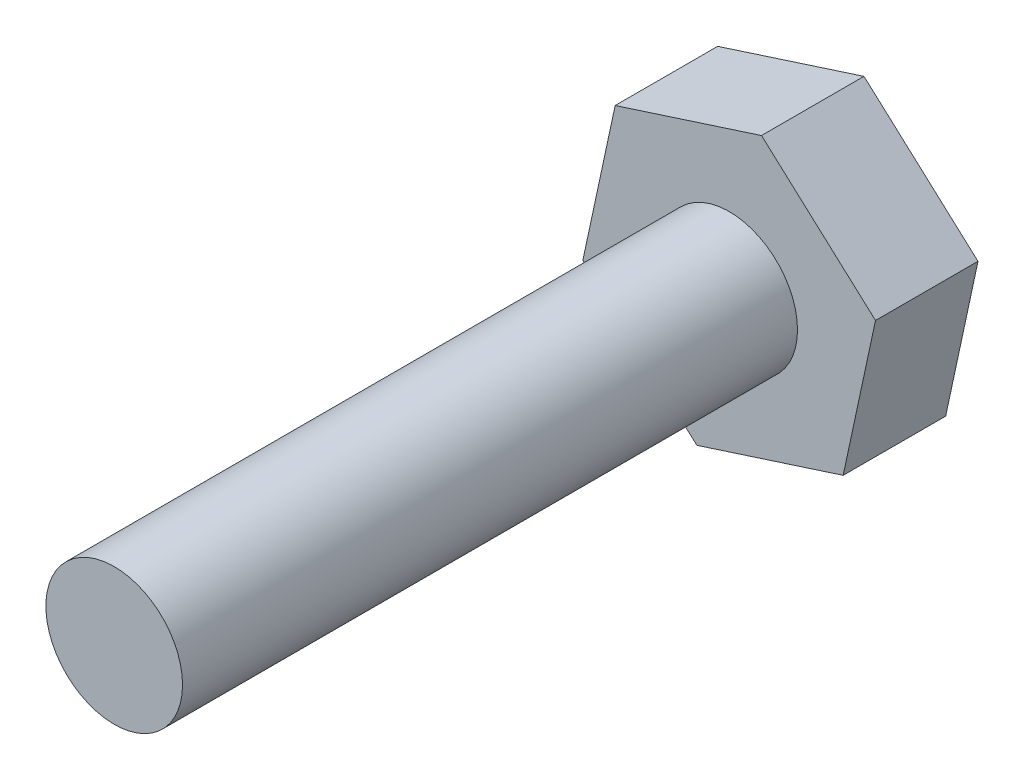
ISO-10303-21;
HEADER;
FILE_DESCRIPTION(('STEP AP214'),'2;1');
FILE_NAME('part.step','',(''),(''),'','','');
FILE_SCHEMA(('AUTOMOTIVE_DESIGN { 1 0 10303 214 1 1 1 1 }'));
ENDSEC;
DATA;
#1=APPLICATION_CONTEXT('core data for automotive mechanical design processes');
#2=APPLICATION_PROTOCOL_DEFINITION('international standard','automotive_design',2000,#1);
#3=PRODUCT_CONTEXT('',#1,'mechanical');
#4=PRODUCT('Part','Part','',(#3));
#5=PRODUCT_RELATED_PRODUCT_CATEGORY('part','',(#4));
#6=PRODUCT_DEFINITION_FORMATION('','',#4);
#7=PRODUCT_DEFINITION_CONTEXT('part definition',#1,'design');
#8=PRODUCT_DEFINITION('design','',#6,#7);
#9=PRODUCT_DEFINITION_SHAPE('','',#8);
#10=(LENGTH_UNIT() NAMED_UNIT(*) SI_UNIT(.MILLI.,.METRE.));
#11=(NAMED_UNIT(*) PLANE_ANGLE_UNIT() SI_UNIT($,.RADIAN.));
#12=(NAMED_UNIT(*) SI_UNIT($,.STERADIAN.) SOLID_ANGLE_UNIT());
#13=UNCERTAINTY_MEASURE_WITH_UNIT(LENGTH_MEASURE(1.E-05),#10,'distance_accuracy_value','');
#14=(GEOMETRIC_REPRESENTATION_CONTEXT(3) GLOBAL_UNCERTAINTY_ASSIGNED_CONTEXT((#13)) GLOBAL_UNIT_ASSIGNED_CONTEXT((#10,
#11,#12)) REPRESENTATION_CONTEXT('',''));
#15=CARTESIAN_POINT('',(0.,0.,0.));
#16=DIRECTION('',(0.,0.,1.));
#17=DIRECTION('',(1.,0.,0.));
#18=AXIS2_PLACEMENT_3D('',#15,#16,#17);
#19=CARTESIAN_POINT('',(-0.946310954574717,-4.39937445294805,3.));
#20=DIRECTION('',(-0.306701755540625,0.951805669844585,0.));
#21=DIRECTION('',(-0.951805669844585,-0.306701755540625,0.));
#22=AXIS2_PLACEMENT_3D('',#19,#20,#21);
#23=PLANE('',#22);
#24=DIRECTION('',(0.951805669844585,0.306701755540625,0.));
#25=VECTOR('',#24,1.);
#26=CARTESIAN_POINT('',(-0.946310954574717,-4.39937445294805,0.));
#27=LINE('',#26,#25);
#28=CARTESIAN_POINT('',(-0.946310954574717,-4.39937445294805,0.));
#29=VERTEX_POINT('',#28);
#30=CARTESIAN_POINT('',(3.33681455972591,-3.01921655301524,0.));
#31=VERTEX_POINT('',#30);
#32=EDGE_CURVE('E130',#29,#31,#27,.T.);
#33=ORIENTED_EDGE('',*,*,#32,.T.);
#34=DIRECTION('',(0.,0.,-1.));
#35=VECTOR('',#34,1.);
#36=CARTESIAN_POINT('',(3.33681455972591,-3.01921655301524,3.));
#37=LINE('',#36,#35);
#38=CARTESIAN_POINT('',(3.33681455972591,-3.01921655301524,3.));
#39=VERTEX_POINT('',#38);
#40=EDGE_CURVE('E42',#39,#31,#37,.T.);
#41=ORIENTED_EDGE('',*,*,#40,.F.);
#42=DIRECTION('',(0.951805669844585,0.306701755540625,0.));
#43=VECTOR('',#42,1.);
#44=CARTESIAN_POINT('',(-0.946310954574717,-4.39937445294805,3.));
#45=LINE('',#44,#43);
#46=CARTESIAN_POINT('',(-0.946310954574717,-4.39937445294805,3.));
#47=VERTEX_POINT('',#46);
#48=EDGE_CURVE('E147',#47,#39,#45,.T.);
#49=ORIENTED_EDGE('',*,*,#48,.F.);
#50=DIRECTION('',(0.,0.,-1.));
#51=VECTOR('',#50,1.);
#52=CARTESIAN_POINT('',(-0.946310954574717,-4.39937445294805,3.));
#53=LINE('',#52,#51);
#54=EDGE_CURVE('E126',#47,#29,#53,.T.);
#55=ORIENTED_EDGE('',*,*,#54,.T.);
#56=EDGE_LOOP('',(#33,#41,#49,#55));
#57=FACE_BOUND('',#56,.T.);
#58=ADVANCED_FACE('F39',(#57),#23,.F.);
#59=CARTESIAN_POINT('',(3.33681455972591,-3.01921655301524,3.));
#60=DIRECTION('',(-0.977638767321787,0.210291323238825,0.));
#61=DIRECTION('',(-0.210291323238825,-0.977638767321787,0.));
#62=AXIS2_PLACEMENT_3D('',#59,#60,#61);
#63=PLANE('',#62);
#64=DIRECTION('',(0.210291323238825,0.977638767321787,0.));
#65=VECTOR('',#64,1.);
#66=CARTESIAN_POINT('',(3.33681455972591,-3.01921655301524,0.));
#67=LINE('',#66,#65);
#68=CARTESIAN_POINT('',(4.28312551430063,1.38015789993282,0.));
#69=VERTEX_POINT('',#68);
#70=EDGE_CURVE('E134',#31,#69,#67,.T.);
#71=ORIENTED_EDGE('',*,*,#70,.T.);
#72=DIRECTION('',(0.,0.,-1.));
#73=VECTOR('',#72,1.);
#74=CARTESIAN_POINT('',(4.28312551430063,1.38015789993282,3.));
#75=LINE('',#74,#73);
#76=CARTESIAN_POINT('',(4.28312551430063,1.38015789993282,3.));
#77=VERTEX_POINT('',#76);
#78=EDGE_CURVE('E153',#77,#69,#75,.T.);
#79=ORIENTED_EDGE('',*,*,#78,.F.);
#80=DIRECTION('',(0.210291323238825,0.977638767321787,0.));
#81=VECTOR('',#80,1.);
#82=CARTESIAN_POINT('',(3.33681455972591,-3.01921655301524,3.));
#83=LINE('',#82,#81);
#84=EDGE_CURVE('E95',#39,#77,#83,.T.);
#85=ORIENTED_EDGE('',*,*,#84,.F.);
#86=ORIENTED_EDGE('',*,*,#40,.T.);
#87=EDGE_LOOP('',(#71,#79,#85,#86));
#88=FACE_BOUND('',#87,.T.);
#89=ADVANCED_FACE('F160',(#88),#63,.F.);
#90=CARTESIAN_POINT('',(4.28312551430063,1.38015789993282,3.));
#91=DIRECTION('',(-0.670937011781161,-0.741514346605759,0.));
#92=DIRECTION('',(0.741514346605759,-0.670937011781161,0.));
#93=AXIS2_PLACEMENT_3D('',#90,#91,#92);
#94=PLANE('',#93);
#95=DIRECTION('',(-0.741514346605759,0.670937011781161,0.));
#96=VECTOR('',#95,1.);
#97=CARTESIAN_POINT('',(4.28312551430063,1.38015789993282,0.));
#98=LINE('',#97,#96);
#99=CARTESIAN_POINT('',(0.946310954574718,4.39937445294804,0.));
#100=VERTEX_POINT('',#99);
#101=EDGE_CURVE('E138',#69,#100,#98,.T.);
#102=ORIENTED_EDGE('',*,*,#101,.T.);
#103=DIRECTION('',(0.,0.,-1.));
#104=VECTOR('',#103,1.);
#105=CARTESIAN_POINT('',(0.946310954574718,4.39937445294804,3.));
#106=LINE('',#105,#104);
#107=CARTESIAN_POINT('',(0.946310954574718,4.39937445294804,3.));
#108=VERTEX_POINT('',#107);
#109=EDGE_CURVE('E119',#108,#100,#106,.T.);
#110=ORIENTED_EDGE('',*,*,#109,.F.);
#111=DIRECTION('',(-0.741514346605759,0.670937011781161,0.));
#112=VECTOR('',#111,1.);
#113=CARTESIAN_POINT('',(4.28312551430063,1.38015789993282,3.));
#114=LINE('',#113,#112);
#115=EDGE_CURVE('E108',#77,#108,#114,.T.);
#116=ORIENTED_EDGE('',*,*,#115,.F.);
#117=ORIENTED_EDGE('',*,*,#78,.T.);
#118=EDGE_LOOP('',(#102,#110,#116,#117));
#119=FACE_BOUND('',#118,.T.);
#120=ADVANCED_FACE('F166',(#119),#94,.F.);
#121=CARTESIAN_POINT('',(0.946310954574718,4.39937445294804,3.));
#122=DIRECTION('',(0.306701755540624,-0.951805669844585,0.));
#123=DIRECTION('',(0.951805669844585,0.306701755540624,0.));
#124=AXIS2_PLACEMENT_3D('',#121,#122,#123);
#125=PLANE('',#124);
#126=DIRECTION('',(-0.951805669844585,-0.306701755540624,0.));
#127=VECTOR('',#126,1.);
#128=CARTESIAN_POINT('',(0.946310954574718,4.39937445294804,0.));
#129=LINE('',#128,#127);
#130=CARTESIAN_POINT('',(-3.33681455972591,3.01921655301523,0.));
#131=VERTEX_POINT('',#130);
#132=EDGE_CURVE('E117',#100,#131,#129,.T.);
#133=ORIENTED_EDGE('',*,*,#132,.T.);
#134=DIRECTION('',(0.,0.,-1.));
#135=VECTOR('',#134,1.);
#136=CARTESIAN_POINT('',(-3.33681455972591,3.01921655301523,3.));
#137=LINE('',#136,#135);
#138=CARTESIAN_POINT('',(-3.33681455972591,3.01921655301523,3.));
#139=VERTEX_POINT('',#138);
#140=EDGE_CURVE('E114',#139,#131,#137,.T.);
#141=ORIENTED_EDGE('',*,*,#140,.F.);
#142=DIRECTION('',(-0.951805669844585,-0.306701755540624,0.));
#143=VECTOR('',#142,1.);
#144=CARTESIAN_POINT('',(0.946310954574718,4.39937445294804,3.));
#145=LINE('',#144,#143);
#146=EDGE_CURVE('E102',#108,#139,#145,.T.);
#147=ORIENTED_EDGE('',*,*,#146,.F.);
#148=ORIENTED_EDGE('',*,*,#109,.T.);
#149=EDGE_LOOP('',(#133,#141,#147,#148));
#150=FACE_BOUND('',#149,.T.);
#151=ADVANCED_FACE('F115',(#150),#125,.F.);
#152=CARTESIAN_POINT('',(-3.33681455972591,3.01921655301523,3.));
#153=DIRECTION('',(0.977638767321787,-0.210291323238824,0.));
#154=DIRECTION('',(0.210291323238824,0.977638767321788,0.));
#155=AXIS2_PLACEMENT_3D('',#152,#153,#154);
#156=PLANE('',#155);
#157=DIRECTION('',(-0.210291323238824,-0.977638767321788,0.));
#158=VECTOR('',#157,1.);
#159=CARTESIAN_POINT('',(-3.33681455972591,3.01921655301523,0.));
#160=LINE('',#159,#158);
#161=CARTESIAN_POINT('',(-4.28312551430062,-1.38015789993282,0.));
#162=VERTEX_POINT('',#161);
#163=EDGE_CURVE('E80',#131,#162,#160,.T.);
#164=ORIENTED_EDGE('',*,*,#163,.T.);
#165=DIRECTION('',(0.,0.,-1.));
#166=VECTOR('',#165,1.);
#167=CARTESIAN_POINT('',(-4.28312551430062,-1.38015789993282,3.));
#168=LINE('',#167,#166);
#169=CARTESIAN_POINT('',(-4.28312551430062,-1.38015789993282,3.));
#170=VERTEX_POINT('',#169);
#171=EDGE_CURVE('E120',#170,#162,#168,.T.);
#172=ORIENTED_EDGE('',*,*,#171,.F.);
#173=DIRECTION('',(-0.210291323238824,-0.977638767321788,0.));
#174=VECTOR('',#173,1.);
#175=CARTESIAN_POINT('',(-3.33681455972591,3.01921655301523,3.));
#176=LINE('',#175,#174);
#177=EDGE_CURVE('E106',#139,#170,#176,.T.);
#178=ORIENTED_EDGE('',*,*,#177,.F.);
#179=ORIENTED_EDGE('',*,*,#140,.T.);
#180=EDGE_LOOP('',(#164,#172,#178,#179));
#181=FACE_BOUND('',#180,.T.);
#182=ADVANCED_FACE('F122',(#181),#156,.F.);
#183=CARTESIAN_POINT('',(-4.28312551430062,-1.38015789993282,3.));
#184=DIRECTION('',(0.670937011781163,0.741514346605758,0.));
#185=DIRECTION('',(-0.741514346605758,0.670937011781163,0.));
#186=AXIS2_PLACEMENT_3D('',#183,#184,#185);
#187=PLANE('',#186);
#188=DIRECTION('',(0.741514346605758,-0.670937011781163,0.));
#189=VECTOR('',#188,1.);
#190=CARTESIAN_POINT('',(-4.28312551430062,-1.38015789993282,0.));
#191=LINE('',#190,#189);
#192=EDGE_CURVE('E86',#162,#29,#191,.T.);
#193=ORIENTED_EDGE('',*,*,#192,.T.);
#194=ORIENTED_EDGE('',*,*,#54,.F.);
#195=DIRECTION('',(0.741514346605758,-0.670937011781163,0.));
#196=VECTOR('',#195,1.);
#197=CARTESIAN_POINT('',(-4.28312551430062,-1.38015789993282,3.));
#198=LINE('',#197,#196);
#199=EDGE_CURVE('E57',#170,#47,#198,.T.);
#200=ORIENTED_EDGE('',*,*,#199,.F.);
#201=ORIENTED_EDGE('',*,*,#171,.T.);
#202=EDGE_LOOP('',(#193,#194,#200,#201));
#203=FACE_BOUND('',#202,.T.);
#204=ADVANCED_FACE('F186',(#203),#187,.F.);
#205=CARTESIAN_POINT('',(0.,0.,3.));
#206=DIRECTION('',(0.,0.,1.));
#207=DIRECTION('',(1.,0.,0.));
#208=AXIS2_PLACEMENT_3D('',#205,#206,#207);
#209=PLANE('',#208);
#210=CARTESIAN_POINT('',(0.,0.,3.));
#211=DIRECTION('',(0.,0.,1.));
#212=DIRECTION('',(1.,0.,0.));
#213=AXIS2_PLACEMENT_3D('',#210,#211,#212);
#214=CIRCLE('',#213,2.);
#215=CARTESIAN_POINT('',(2.,0.,3.));
#216=VERTEX_POINT('',#215);
#217=EDGE_CURVE('E11',#216,#216,#214,.T.);
#218=ORIENTED_EDGE('',*,*,#217,.F.);
#219=EDGE_LOOP('',(#218));
#220=FACE_BOUND('',#219,.T.);
#221=ORIENTED_EDGE('',*,*,#48,.T.);
#222=ORIENTED_EDGE('',*,*,#84,.T.);
#223=ORIENTED_EDGE('',*,*,#115,.T.);
#224=ORIENTED_EDGE('',*,*,#146,.T.);
#225=ORIENTED_EDGE('',*,*,#177,.T.);
#226=ORIENTED_EDGE('',*,*,#199,.T.);
#227=EDGE_LOOP('',(#221,#222,#223,#224,#225,#226));
#228=FACE_BOUND('',#227,.T.);
#229=ADVANCED_FACE('F104',(#220,#228),#209,.T.);
#230=CARTESIAN_POINT('',(0.,0.,0.));
#231=DIRECTION('',(0.,0.,1.));
#232=DIRECTION('',(1.,0.,0.));
#233=AXIS2_PLACEMENT_3D('',#230,#231,#232);
#234=PLANE('',#233);
#235=ORIENTED_EDGE('',*,*,#32,.F.);
#236=ORIENTED_EDGE('',*,*,#192,.F.);
#237=ORIENTED_EDGE('',*,*,#163,.F.);
#238=ORIENTED_EDGE('',*,*,#132,.F.);
#239=ORIENTED_EDGE('',*,*,#101,.F.);
#240=ORIENTED_EDGE('',*,*,#70,.F.);
#241=EDGE_LOOP('',(#235,#236,#237,#238,#239,#240));
#242=FACE_BOUND('',#241,.T.);
#243=ADVANCED_FACE('F165',(#242),#234,.F.);
#244=CARTESIAN_POINT('',(0.,0.,21.));
#245=DIRECTION('',(0.,0.,-1.));
#246=DIRECTION('',(-1.,0.,0.));
#247=AXIS2_PLACEMENT_3D('',#244,#245,#246);
#248=CYLINDRICAL_SURFACE('',#247,2.);
#249=CARTESIAN_POINT('',(0.,0.,21.));
#250=DIRECTION('',(0.,0.,1.));
#251=DIRECTION('',(1.,0.,0.));
#252=AXIS2_PLACEMENT_3D('',#249,#250,#251);
#253=CIRCLE('',#252,2.);
#254=CARTESIAN_POINT('',(2.,0.,21.));
#255=VERTEX_POINT('',#254);
#256=EDGE_CURVE('E135',#255,#255,#253,.T.);
#257=ORIENTED_EDGE('',*,*,#256,.F.);
#258=EDGE_LOOP('',(#257));
#259=FACE_BOUND('',#258,.T.);
#260=ORIENTED_EDGE('',*,*,#217,.T.);
#261=EDGE_LOOP('',(#260));
#262=FACE_BOUND('',#261,.T.);
#263=ADVANCED_FACE('F179',(#259,#262),#248,.T.);
#264=CARTESIAN_POINT('',(0.,0.,21.));
#265=DIRECTION('',(0.,0.,1.));
#266=DIRECTION('',(1.,0.,0.));
#267=AXIS2_PLACEMENT_3D('',#264,#265,#266);
#268=PLANE('',#267);
#269=ORIENTED_EDGE('',*,*,#256,.T.);
#270=EDGE_LOOP('',(#269));
#271=FACE_BOUND('',#270,.T.);
#272=ADVANCED_FACE('F177',(#271),#268,.T.);
#273=CLOSED_SHELL('',(#58,#89,#120,#151,#182,#204,#229,#243,#263,#272));
#274=MANIFOLD_SOLID_BREP('B2',#273);
#275=ADVANCED_BREP_SHAPE_REPRESENTATION('',(#18,#274),#14);
#276=SHAPE_DEFINITION_REPRESENTATION(#9,#275);
ENDSEC;
END-ISO-10303-21;
